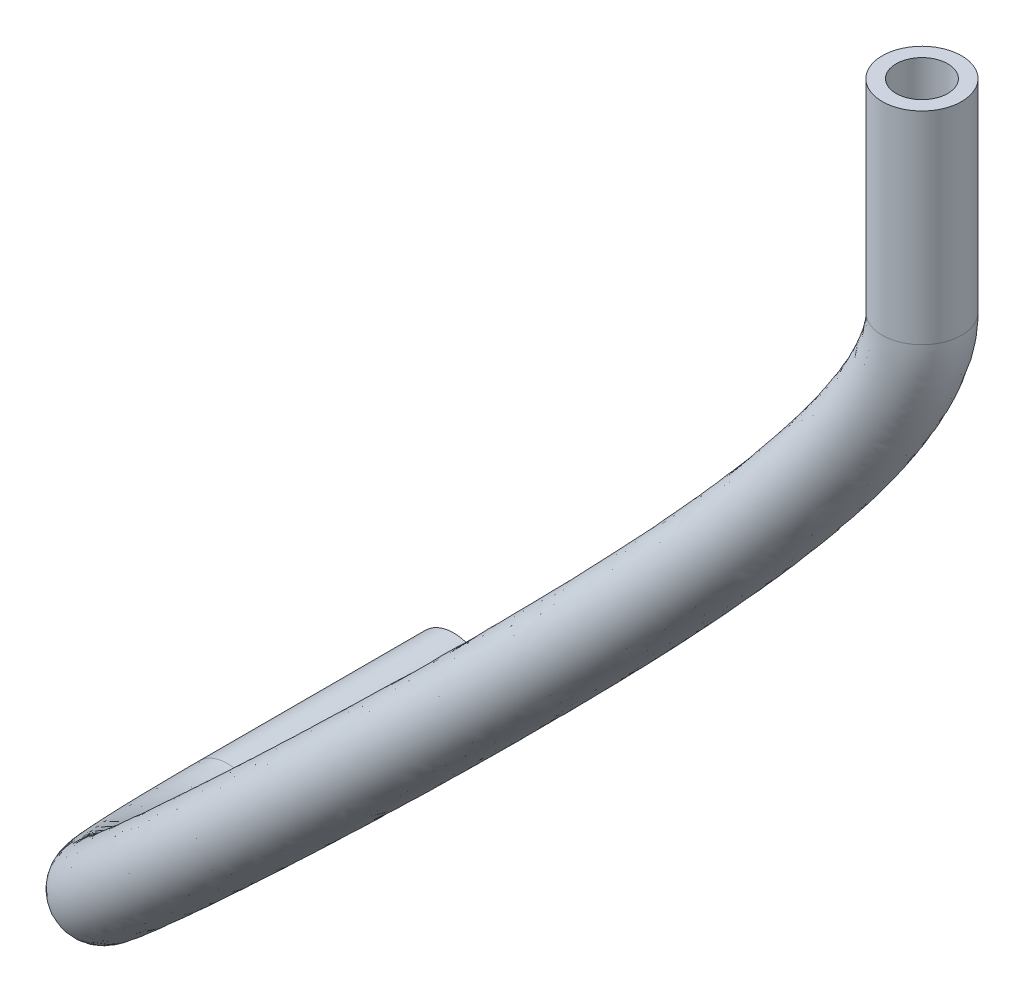
ISO-10303-21;
HEADER;
FILE_DESCRIPTION(('STEP AP214'),'2;1');
FILE_NAME('part.step','',(''),(''),'','','');
FILE_SCHEMA(('AUTOMOTIVE_DESIGN { 1 0 10303 214 1 1 1 1 }'));
ENDSEC;
DATA;
#1=APPLICATION_CONTEXT('core data for automotive mechanical design processes');
#2=APPLICATION_PROTOCOL_DEFINITION('international standard','automotive_design',2000,#1);
#3=PRODUCT_CONTEXT('',#1,'mechanical');
#4=PRODUCT('Part','Part','',(#3));
#5=PRODUCT_RELATED_PRODUCT_CATEGORY('part','',(#4));
#6=PRODUCT_DEFINITION_FORMATION('','',#4);
#7=PRODUCT_DEFINITION_CONTEXT('part definition',#1,'design');
#8=PRODUCT_DEFINITION('design','',#6,#7);
#9=PRODUCT_DEFINITION_SHAPE('','',#8);
#10=(LENGTH_UNIT() NAMED_UNIT(*) SI_UNIT(.MILLI.,.METRE.));
#11=(NAMED_UNIT(*) PLANE_ANGLE_UNIT() SI_UNIT($,.RADIAN.));
#12=(NAMED_UNIT(*) SI_UNIT($,.STERADIAN.) SOLID_ANGLE_UNIT());
#13=UNCERTAINTY_MEASURE_WITH_UNIT(LENGTH_MEASURE(1.E-05),#10,'distance_accuracy_value','');
#14=(GEOMETRIC_REPRESENTATION_CONTEXT(3) GLOBAL_UNCERTAINTY_ASSIGNED_CONTEXT((#13)) GLOBAL_UNIT_ASSIGNED_CONTEXT((#10,
#11,#12)) REPRESENTATION_CONTEXT('',''));
#15=CARTESIAN_POINT('',(0.,0.,0.));
#16=DIRECTION('',(0.,0.,1.));
#17=DIRECTION('',(1.,0.,0.));
#18=AXIS2_PLACEMENT_3D('',#15,#16,#17);
#19=CARTESIAN_POINT('',(-150.085279081331,-109.48225656367,-25.5249999999999));
#20=DIRECTION('',(0.,-1.,0.));
#21=DIRECTION('',(1.,0.,0.));
#22=AXIS2_PLACEMENT_3D('',#19,#20,#21);
#23=CYLINDRICAL_SURFACE('',#22,2.);
#24=CARTESIAN_POINT('',(-150.085279081331,-119.68225656367,-25.5249999999999));
#25=DIRECTION('',(0.,1.,0.));
#26=DIRECTION('',(0.550918603506274,0.,-0.834558980726166));
#27=AXIS2_PLACEMENT_3D('',#24,#25,#26);
#28=CIRCLE('',#27,2.);
#29=CARTESIAN_POINT('',(-148.983441874318,-119.68225656367,-27.1941179614522));
#30=VERTEX_POINT('',#29);
#31=EDGE_CURVE('E106',#30,#30,#28,.T.);
#32=ORIENTED_EDGE('',*,*,#31,.T.);
#33=EDGE_LOOP('',(#32));
#34=FACE_BOUND('',#33,.T.);
#35=CARTESIAN_POINT('',(-150.085279081331,-109.48225656367,-25.5249999999999));
#36=DIRECTION('',(0.,1.,0.));
#37=DIRECTION('',(0.550918603506274,0.,-0.834558980726166));
#38=AXIS2_PLACEMENT_3D('',#35,#36,#37);
#39=CIRCLE('',#38,2.);
#40=CARTESIAN_POINT('',(-148.983441874318,-109.48225656367,-27.1941179614522));
#41=VERTEX_POINT('',#40);
#42=EDGE_CURVE('E48',#41,#41,#39,.T.);
#43=ORIENTED_EDGE('',*,*,#42,.F.);
#44=EDGE_LOOP('',(#43));
#45=FACE_BOUND('',#44,.T.);
#46=ADVANCED_FACE('F33',(#34,#45),#23,.T.);
#47=CARTESIAN_POINT('',(-148.983441874318,-119.68225656367,-27.1941179614523));
#48=CARTESIAN_POINT('',(-148.983441897184,-120.456039775947,-27.1941179597935));
#49=CARTESIAN_POINT('',(-149.162347550547,-121.244423133549,-27.1869869175737));
#50=CARTESIAN_POINT('',(-149.764550663643,-122.904200186474,-27.1712213938091));
#51=CARTESIAN_POINT('',(-150.192613918836,-123.777961004158,-27.162305851847));
#52=CARTESIAN_POINT('',(-151.813182216644,-126.573543563266,-27.1455997404526));
#53=CARTESIAN_POINT('',(-153.345271112655,-128.671191860527,-27.1476762962332));
#54=CARTESIAN_POINT('',(-159.051089719055,-135.640781444132,-27.2968705727352));
#55=CARTESIAN_POINT('',(-164.337628455707,-141.180299200762,-27.5871290015267));
#56=CARTESIAN_POINT('',(-172.408396611259,-149.283351188635,-28.6011287771844));
#57=CARTESIAN_POINT('',(-174.51038109641,-151.36766540929,-28.9068183581806));
#58=CARTESIAN_POINT('',(-177.709340016986,-154.511126064397,-29.4629408200434));
#59=CARTESIAN_POINT('',(-178.787663561716,-155.556189535605,-29.669291376055));
#60=CARTESIAN_POINT('',(-180.911336099532,-157.683925468385,-30.0807411263178));
#61=CARTESIAN_POINT('',(-181.969791613986,-158.75098605433,-30.2985291854538));
#62=CARTESIAN_POINT('',(-187.261247165362,-164.008463474276,-31.5114807766749));
#63=CARTESIAN_POINT('',(-191.43457191409,-168.038229231615,-32.8225757612156));
#64=CARTESIAN_POINT('',(-196.900296980634,-173.268247260522,-35.4010580197518));
#65=CARTESIAN_POINT('',(-198.590098065337,-174.874862790016,-36.3625477392241));
#66=CARTESIAN_POINT('',(-201.589385937694,-177.716017797002,-38.4940165164925));
#67=CARTESIAN_POINT('',(-202.897981659391,-178.949681476636,-39.6643597337115));
#68=CARTESIAN_POINT('',(-205.028547979079,-180.953663798086,-42.1943373775755));
#69=CARTESIAN_POINT('',(-205.848714192953,-181.722307891496,-43.5494869282504));
#70=CARTESIAN_POINT('',(-206.677088701443,-182.498504583847,-45.7176638956701));
#71=CARTESIAN_POINT('',(-206.887139883348,-182.695274666823,-46.4638053548163));
#72=CARTESIAN_POINT('',(-207.100289998218,-182.895404227859,-47.631300841757));
#73=CARTESIAN_POINT('',(-207.154313688162,-182.946239905505,-48.0286354347202));
#74=CARTESIAN_POINT('',(-207.20884144759,-182.997844753575,-48.6392038488103));
#75=CARTESIAN_POINT('',(-207.222593690969,-183.010932930445,-48.8451564275358));
#76=CARTESIAN_POINT('',(-207.236414145537,-183.0242425514,-49.1580178635063));
#77=CARTESIAN_POINT('',(-207.239885958085,-183.027624988679,-49.2629603231285));
#78=CARTESIAN_POINT('',(-207.243366585763,-183.031095611945,-49.4213914113405));
#79=CARTESIAN_POINT('',(-207.244238926367,-183.031985295598,-49.4743713266637));
#80=CARTESIAN_POINT('',(-207.245403539652,-183.033226418273,-49.5806758159231));
#81=CARTESIAN_POINT('',(-207.245695812187,-183.033618015718,-49.6249759760826));
#82=CARTESIAN_POINT('',(-207.245695812187,-183.033658174273,-49.6875000000002));
#83=CARTESIAN_POINT('',(-152.321677797223,-119.68225656367,-29.3977923754774));
#84=CARTESIAN_POINT('',(-152.321677768971,-119.934449456256,-29.3977923757213));
#85=CARTESIAN_POINT('',(-152.394269291203,-120.37686228989,-29.3945394179097));
#86=CARTESIAN_POINT('',(-152.814419953724,-121.534736218641,-29.3834903196071));
#87=CARTESIAN_POINT('',(-153.154507355048,-122.245616360076,-29.3761467822244));
#88=CARTESIAN_POINT('',(-154.552009034838,-124.65636568068,-29.3617212738474));
#89=CARTESIAN_POINT('',(-155.981517872258,-126.631338921823,-29.3625471001761));
#90=CARTESIAN_POINT('',(-161.443643889273,-133.303237304617,-29.5053475616698));
#91=CARTESIAN_POINT('',(-166.64402741672,-138.76188734774,-29.7879588381301));
#92=CARTESIAN_POINT('',(-174.612796067743,-146.762531812739,-30.7891435297816));
#93=CARTESIAN_POINT('',(-176.688843316581,-148.821115479188,-31.0910680199326));
#94=CARTESIAN_POINT('',(-179.845855303803,-151.923356923575,-31.6398982144051));
#95=CARTESIAN_POINT('',(-180.917955711306,-152.948955956534,-31.8296533211223));
#96=CARTESIAN_POINT('',(-182.963498828231,-155.078212876033,-32.3172261657293));
#97=CARTESIAN_POINT('',(-183.97156530236,-156.15156159579,-32.5873976647357));
#98=CARTESIAN_POINT('',(-189.049407452233,-161.402709374212,-33.973373880025));
#99=CARTESIAN_POINT('',(-193.075921694928,-165.375550337584,-35.3255075867565));
#100=CARTESIAN_POINT('',(-198.264893594861,-170.428476492511,-37.8679826223907));
#101=CARTESIAN_POINT('',(-199.85277465201,-171.959881986369,-38.7990218512336));
#102=CARTESIAN_POINT('',(-202.611743508533,-174.608353354422,-40.8016295808639));
#103=CARTESIAN_POINT('',(-203.780269775653,-175.722944562847,-41.8741448271047));
#104=CARTESIAN_POINT('',(-205.59480246807,-177.451081126897,-44.061068228466));
#105=CARTESIAN_POINT('',(-206.235654171147,-178.059856042294,-45.16263111329));
#106=CARTESIAN_POINT('',(-206.847945594157,-178.644259445172,-46.7932938942775));
#107=CARTESIAN_POINT('',(-206.99646256431,-178.786645667883,-47.3356196697458));
#108=CARTESIAN_POINT('',(-207.146361374482,-178.931985252226,-48.1804233475116));
#109=CARTESIAN_POINT('',(-207.18407146393,-178.968954135262,-48.467592009551));
#110=CARTESIAN_POINT('',(-207.221805434308,-179.006842154852,-48.9127414453875));
#111=CARTESIAN_POINT('',(-207.231228590174,-179.016528740498,-49.0635297359131));
#112=CARTESIAN_POINT('',(-207.240428627077,-179.02646445453,-49.294072067111));
#113=CARTESIAN_POINT('',(-207.242671846329,-179.029009726136,-49.3716458341776));
#114=CARTESIAN_POINT('',(-207.244767524197,-179.031647140509,-49.4891855234972));
#115=CARTESIAN_POINT('',(-207.245254500818,-179.032329476415,-49.528561886727));
#116=CARTESIAN_POINT('',(-207.245798962205,-179.033294835005,-49.6077219448447));
#117=CARTESIAN_POINT('',(-207.245776129297,-179.033618015718,-49.6317286013142));
#118=CARTESIAN_POINT('',(-207.245695812187,-179.033658174273,-49.6875000000002));
#119=CARTESIAN_POINT('',(-154.525352211248,-119.68225656367,-26.0595564525727));
#120=CARTESIAN_POINT('',(-154.525352142405,-119.558722181537,-26.0595564542233));
#121=CARTESIAN_POINT('',(-154.522381395833,-119.762565249145,-26.0590466544318));
#122=CARTESIAN_POINT('',(-154.820973677586,-120.585551821401,-26.051145031679));
#123=CARTESIAN_POINT('',(-155.105533377014,-121.195380128233,-26.0447679320219));
#124=CARTESIAN_POINT('',(-156.371997046522,-123.380118861525,-26.0316803428964));
#125=CARTESIAN_POINT('',(-157.755130044631,-125.304225375806,-26.0316630280117));
#126=CARTESIAN_POINT('',(-163.138453544637,-131.879901609233,-26.1723890335801));
#127=CARTESIAN_POINT('',(-168.360221199002,-137.367710714703,-26.4538717577234));
#128=CARTESIAN_POINT('',(-176.39648534191,-145.436120676431,-27.4635364796285));
#129=CARTESIAN_POINT('',(-178.494231252472,-147.516280129659,-27.7684992766372));
#130=CARTESIAN_POINT('',(-181.692144665401,-150.658713419883,-28.324439967437));
#131=CARTESIAN_POINT('',(-182.770590709896,-151.710191032389,-28.5075673048871));
#132=CARTESIAN_POINT('',(-184.901535691994,-153.806411140357,-29.0569218958629));
#133=CARTESIAN_POINT('',(-185.962445352324,-154.852068221561,-29.3701251802754));
#134=CARTESIAN_POINT('',(-191.256356732263,-160.037689868164,-30.9211361910097));
#135=CARTESIAN_POINT('',(-195.416075377529,-164.045841626745,-32.3571053754043));
#136=CARTESIAN_POINT('',(-200.873848760164,-169.255387693949,-35.0695581250287));
#137=CARTESIAN_POINT('',(-202.562289983673,-170.858179538684,-36.064582668345));
#138=CARTESIAN_POINT('',(-205.563075740601,-173.69694712863,-38.2538156148616));
#139=CARTESIAN_POINT('',(-206.874640878064,-174.932199807307,-39.4482424437249));
#140=CARTESIAN_POINT('',(-209.015147252151,-176.943628052325,-42.0290384328886));
#141=CARTESIAN_POINT('',(-209.842542540059,-177.718382279912,-43.4115320739775));
#142=CARTESIAN_POINT('',(-210.678316525007,-178.500682981376,-45.628908520926));
#143=CARTESIAN_POINT('',(-210.890127919982,-178.698857507296,-46.3926777134203));
#144=CARTESIAN_POINT('',(-211.10379273339,-178.899144335294,-47.587104240912));
#145=CARTESIAN_POINT('',(-211.157639363508,-178.949712929803,-47.9934790446434));
#146=CARTESIAN_POINT('',(-211.211335415395,-179.00039705645,-48.6174318011313));
#147=CARTESIAN_POINT('',(-211.224716905171,-179.013092423794,-48.8278161765493));
#148=CARTESIAN_POINT('',(-211.237843063218,-179.025685873142,-49.147246923369));
#149=CARTESIAN_POINT('',(-211.241060467663,-179.028808475189,-49.2543661043153));
#150=CARTESIAN_POINT('',(-211.244125726474,-179.031858328092,-49.4160386772709));
#151=CARTESIAN_POINT('',(-211.244853987621,-179.032602588111,-49.4700951565673));
#152=CARTESIAN_POINT('',(-211.245719347643,-179.03354266981,-49.5785442671312));
#153=CARTESIAN_POINT('',(-211.245776129297,-179.033698332828,-49.6244442303279));
#154=CARTESIAN_POINT('',(-211.245695812187,-179.033658174273,-49.6875000000002));
#155=CARTESIAN_POINT('',(-151.187116288344,-119.68225656367,-23.8558820385476));
#156=CARTESIAN_POINT('',(-151.187116270617,-120.080312501239,-23.8558820383525));
#157=CARTESIAN_POINT('',(-151.290459655182,-120.630126092804,-23.8514941540847));
#158=CARTESIAN_POINT('',(-151.771104387499,-121.955015789234,-23.838876105892));
#159=CARTESIAN_POINT('',(-152.143639940808,-122.727724772314,-23.8309270016588));
#160=CARTESIAN_POINT('',(-153.633170228314,-125.297296744111,-23.8155588094728));
#161=CARTESIAN_POINT('',(-155.118883285028,-127.34407831451,-23.8167922240688));
#162=CARTESIAN_POINT('',(-160.745899374418,-134.217445748748,-23.9639120446455));
#163=CARTESIAN_POINT('',(-166.05382223793,-139.786122567724,-24.2530419211199));
#164=CARTESIAN_POINT('',(-174.192085885446,-147.956940052327,-25.2755217270313));
#165=CARTESIAN_POINT('',(-176.315769032301,-150.062830059762,-25.5842496149273));
#166=CARTESIAN_POINT('',(-179.555629378584,-153.246482560705,-26.1474825730542));
#167=CARTESIAN_POINT('',(-180.640298560327,-154.317424611459,-26.3472053597986));
#168=CARTESIAN_POINT('',(-182.849372963273,-156.412123732709,-26.8204368564726));
#169=CARTESIAN_POINT('',(-183.960671663951,-157.451492680112,-27.0812567009723));
#170=CARTESIAN_POINT('',(-189.468196445392,-162.643443968186,-28.4592430877442));
#171=CARTESIAN_POINT('',(-193.774725596804,-166.708520520776,-29.8541735498634));
#172=CARTESIAN_POINT('',(-199.509252145881,-172.09515846196,-32.6026335223898));
#173=CARTESIAN_POINT('',(-201.299613396984,-173.773160342381,-33.6281085563858));
#174=CARTESIAN_POINT('',(-204.540718169778,-176.80461157116,-35.94620255044));
#175=CARTESIAN_POINT('',(-205.992352761801,-178.158936721095,-37.2384573503462));
#176=CARTESIAN_POINT('',(-208.44889276316,-180.446210723514,-40.1623075819836));
#177=CARTESIAN_POINT('',(-209.455602561864,-181.380834129114,-41.7983878889379));
#178=CARTESIAN_POINT('',(-210.507459632294,-182.354928120051,-44.5532785223186));
#179=CARTESIAN_POINT('',(-210.780805239019,-182.607486506236,-45.5208633984908));
#180=CARTESIAN_POINT('',(-211.057721357127,-182.862563310927,-47.0379817351574));
#181=CARTESIAN_POINT('',(-211.12788158774,-182.926998700047,-47.5545224698125));
#182=CARTESIAN_POINT('',(-211.198371428676,-182.991399655173,-48.3438942045541));
#183=CARTESIAN_POINT('',(-211.216082005965,-183.007496613741,-48.6094428681716));
#184=CARTESIAN_POINT('',(-211.233828581678,-183.023463970012,-49.0111927197644));
#185=CARTESIAN_POINT('',(-211.238274579419,-183.027423737732,-49.1456805932664));
#186=CARTESIAN_POINT('',(-211.242724788039,-183.031306799528,-49.3482445651141));
#187=CARTESIAN_POINT('',(-211.24383841317,-183.032258407294,-49.4159045965041));
#188=CARTESIAN_POINT('',(-211.245323925091,-183.033474253078,-49.5514981382094));
#189=CARTESIAN_POINT('',(-211.245695812187,-183.033698332828,-49.6176916050963));
#190=CARTESIAN_POINT('',(-211.245695812187,-183.033658174273,-49.6875000000002));
#191=CARTESIAN_POINT('',(-147.848880365439,-119.68225656367,-21.6522076245225));
#192=CARTESIAN_POINT('',(-147.84888039883,-120.60190282094,-21.6522076224815));
#193=CARTESIAN_POINT('',(-148.058537914531,-121.497686936463,-21.6439416537376));
#194=CARTESIAN_POINT('',(-148.721235097412,-123.324479757067,-21.626607180105));
#195=CARTESIAN_POINT('',(-149.181746504603,-124.260069416396,-21.6170860712957));
#196=CARTESIAN_POINT('',(-150.894343410105,-127.214474626696,-21.5994372760493));
#197=CARTESIAN_POINT('',(-152.482636525426,-129.383931253213,-21.6019214201258));
#198=CARTESIAN_POINT('',(-158.353345204199,-136.554989888262,-21.7554350557109));
#199=CARTESIAN_POINT('',(-163.747423276857,-142.204534420746,-22.0522120845165));
#200=CARTESIAN_POINT('',(-171.987686428982,-150.477759428223,-23.0875069744341));
#201=CARTESIAN_POINT('',(-174.137306812129,-152.609379989864,-23.3999999532174));
#202=CARTESIAN_POINT('',(-177.419114091766,-155.834251701528,-23.9705251786715));
#203=CARTESIAN_POINT('',(-178.510006410759,-156.92465819053,-24.1868434147102));
#204=CARTESIAN_POINT('',(-180.797210234552,-159.017836325062,-24.5839518170823));
#205=CARTESIAN_POINT('',(-181.958897975577,-160.050917138663,-24.7923882216693));
#206=CARTESIAN_POINT('',(-187.68003615852,-165.249198068208,-25.9973499844788));
#207=CARTESIAN_POINT('',(-192.133375816079,-169.371199414808,-27.3512417243225));
#208=CARTESIAN_POINT('',(-198.144655531597,-174.934929229971,-30.1357089197509));
#209=CARTESIAN_POINT('',(-200.036936810294,-176.688141146078,-31.1916344444265));
#210=CARTESIAN_POINT('',(-203.518360598955,-179.91227601369,-33.6385894860183));
#211=CARTESIAN_POINT('',(-205.110064645539,-181.385673634884,-35.0286722569674));
#212=CARTESIAN_POINT('',(-207.882638274168,-183.948793394704,-38.2955767310787));
#213=CARTESIAN_POINT('',(-209.06866258367,-185.043285978316,-40.1852437038982));
#214=CARTESIAN_POINT('',(-210.33660273958,-186.209173258726,-43.4776485237111));
#215=CARTESIAN_POINT('',(-210.671482558057,-186.516115505175,-44.6490490835612));
#216=CARTESIAN_POINT('',(-211.011649980864,-186.825982286561,-46.4888592294028));
#217=CARTESIAN_POINT('',(-211.098123811973,-186.904284470291,-47.1155658949816));
#218=CARTESIAN_POINT('',(-211.185407441958,-186.982402253896,-48.0703566079769));
#219=CARTESIAN_POINT('',(-211.20744710676,-187.001900803688,-48.3910695597939));
#220=CARTESIAN_POINT('',(-211.229814100138,-187.021242066882,-48.8751385161599));
#221=CARTESIAN_POINT('',(-211.235488691174,-187.026039000275,-49.0369950822175));
#222=CARTESIAN_POINT('',(-211.241323849605,-187.030755270964,-49.2804504529573));
#223=CARTESIAN_POINT('',(-211.242822838719,-187.031914226476,-49.3617140364409));
#224=CARTESIAN_POINT('',(-211.244928502538,-187.033405836347,-49.5244520092876));
#225=CARTESIAN_POINT('',(-211.245615495076,-187.033698332828,-49.6109389798647));
#226=CARTESIAN_POINT('',(-211.245695812187,-187.033658174273,-49.6875000000002));
#227=CARTESIAN_POINT('',(-145.645205951414,-119.68225656367,-24.9904435474272));
#228=CARTESIAN_POINT('',(-145.645206025396,-120.977630095638,-24.9904435438657));
#229=CARTESIAN_POINT('',(-145.930425809891,-122.111983977208,-24.9794344172375));
#230=CARTESIAN_POINT('',(-146.714681373561,-124.273664154307,-24.9589524680111));
#231=CARTESIAN_POINT('',(-147.230720482623,-125.310305648239,-24.9484649214695));
#232=CARTESIAN_POINT('',(-149.074355398451,-128.490721445852,-24.9294782070577));
#233=CARTESIAN_POINT('',(-150.709024353052,-130.71104479923,-24.9328054922902));
#234=CARTESIAN_POINT('',(-156.658535548836,-137.978325583646,-25.0883935838006));
#235=CARTESIAN_POINT('',(-162.031229494695,-143.598711053783,-25.3862991649232));
#236=CARTESIAN_POINT('',(-170.203997154775,-151.80417056453,-26.4131140245872));
#237=CARTESIAN_POINT('',(-172.331918876238,-153.914215339393,-26.7225686964287));
#238=CARTESIAN_POINT('',(-175.572824730169,-157.09889520522,-27.2859834256817));
#239=CARTESIAN_POINT('',(-176.657371412127,-158.163423114675,-27.5089294309878));
#240=CARTESIAN_POINT('',(-178.859173370832,-160.289638060738,-27.8442560869063));
#241=CARTESIAN_POINT('',(-179.968017925612,-161.35041051287,-28.0096607061719));
#242=CARTESIAN_POINT('',(-185.473086878491,-166.61421757434,-29.0495876733247));
#243=CARTESIAN_POINT('',(-189.793222133252,-170.700908125646,-30.3196439356747));
#244=CARTESIAN_POINT('',(-195.535700366407,-176.108018028533,-32.9341334171129));
#245=CARTESIAN_POINT('',(-197.327421478664,-177.789843593662,-33.9260736272146));
#246=CARTESIAN_POINT('',(-200.567028366854,-180.823682239582,-36.186403452121));
#247=CARTESIAN_POINT('',(-202.015693543128,-182.176418390424,-37.4545746403184));
#248=CARTESIAN_POINT('',(-204.462293490087,-184.456246469275,-40.327606526685));
#249=CARTESIAN_POINT('',(-205.461774214758,-185.384759740698,-41.9363427432107));
#250=CARTESIAN_POINT('',(-206.50623180873,-186.352749722522,-44.6420338970626));
#251=CARTESIAN_POINT('',(-206.777817202385,-186.603903665762,-45.5919910398868));
#252=CARTESIAN_POINT('',(-207.054218621955,-186.858823203493,-47.0821783360024));
#253=CARTESIAN_POINT('',(-207.124555912395,-186.923525675749,-47.5896788598893));
#254=CARTESIAN_POINT('',(-207.195877460871,-186.988847352298,-48.3656662522331));
#255=CARTESIAN_POINT('',(-207.213958791763,-187.005337120392,-48.6267831191585));
#256=CARTESIAN_POINT('',(-207.232399663997,-187.022020648269,-49.0219636599016));
#257=CARTESIAN_POINT('',(-207.23710006984,-187.026240251222,-49.1542748120793));
#258=CARTESIAN_POINT('',(-207.241965647328,-187.030544083382,-49.3535972991838));
#259=CARTESIAN_POINT('',(-207.243223351916,-187.03164111478,-49.4201807666004));
#260=CARTESIAN_POINT('',(-207.245008117099,-187.033158001542,-49.5536296870014));
#261=CARTESIAN_POINT('',(-207.245615495076,-187.033618015718,-49.618223350851));
#262=CARTESIAN_POINT('',(-207.245695812187,-187.033658174273,-49.6875000000002));
#263=CARTESIAN_POINT('',(-148.983441874318,-119.68225656367,-27.1941179614523));
#264=CARTESIAN_POINT('',(-148.983441897184,-120.456039775947,-27.1941179597935));
#265=CARTESIAN_POINT('',(-149.162347550547,-121.244423133549,-27.1869869175737));
#266=CARTESIAN_POINT('',(-149.764550663643,-122.904200186474,-27.1712213938091));
#267=CARTESIAN_POINT('',(-150.192613918836,-123.777961004158,-27.162305851847));
#268=CARTESIAN_POINT('',(-151.813182216644,-126.573543563266,-27.1455997404526));
#269=CARTESIAN_POINT('',(-153.345271112655,-128.671191860527,-27.1476762962332));
#270=CARTESIAN_POINT('',(-159.051089719055,-135.640781444132,-27.2968705727352));
#271=CARTESIAN_POINT('',(-164.337628455707,-141.180299200762,-27.5871290015267));
#272=CARTESIAN_POINT('',(-172.408396611259,-149.283351188635,-28.6011287771844));
#273=CARTESIAN_POINT('',(-174.51038109641,-151.36766540929,-28.9068183581806));
#274=CARTESIAN_POINT('',(-177.709340016986,-154.511126064397,-29.4629408200434));
#275=CARTESIAN_POINT('',(-178.787663561716,-155.556189535605,-29.669291376055));
#276=CARTESIAN_POINT('',(-180.911336099532,-157.683925468385,-30.0807411263178));
#277=CARTESIAN_POINT('',(-181.969791613986,-158.75098605433,-30.2985291854538));
#278=CARTESIAN_POINT('',(-187.261247165362,-164.008463474276,-31.5114807766749));
#279=CARTESIAN_POINT('',(-191.43457191409,-168.038229231615,-32.8225757612156));
#280=CARTESIAN_POINT('',(-196.900296980634,-173.268247260522,-35.4010580197518));
#281=CARTESIAN_POINT('',(-198.590098065337,-174.874862790016,-36.3625477392241));
#282=CARTESIAN_POINT('',(-201.589385937694,-177.716017797002,-38.4940165164925));
#283=CARTESIAN_POINT('',(-202.897981659391,-178.949681476636,-39.6643597337115));
#284=CARTESIAN_POINT('',(-205.028547979079,-180.953663798086,-42.1943373775755));
#285=CARTESIAN_POINT('',(-205.848714192953,-181.722307891496,-43.5494869282504));
#286=CARTESIAN_POINT('',(-206.677088701443,-182.498504583847,-45.7176638956701));
#287=CARTESIAN_POINT('',(-206.887139883348,-182.695274666823,-46.4638053548163));
#288=CARTESIAN_POINT('',(-207.100289998218,-182.895404227859,-47.631300841757));
#289=CARTESIAN_POINT('',(-207.154313688162,-182.946239905505,-48.0286354347202));
#290=CARTESIAN_POINT('',(-207.20884144759,-182.997844753575,-48.6392038488103));
#291=CARTESIAN_POINT('',(-207.222593690969,-183.010932930445,-48.8451564275358));
#292=CARTESIAN_POINT('',(-207.236414145537,-183.0242425514,-49.1580178635063));
#293=CARTESIAN_POINT('',(-207.239885958085,-183.027624988679,-49.2629603231285));
#294=CARTESIAN_POINT('',(-207.243366585763,-183.031095611945,-49.4213914113405));
#295=CARTESIAN_POINT('',(-207.244238926367,-183.031985295598,-49.4743713266637));
#296=CARTESIAN_POINT('',(-207.245403539652,-183.033226418273,-49.5806758159231));
#297=CARTESIAN_POINT('',(-207.245695812187,-183.033618015718,-49.6249759760826));
#298=CARTESIAN_POINT('',(-207.245695812187,-183.033658174273,-49.6875000000002));
#299=(BOUNDED_SURFACE() B_SPLINE_SURFACE(3,3,((#47,#48,#49,#50,#51,#52,#53,#54,#55,#56,#57,#58,
#59,#60,#61,#62,#63,#64,#65,#66,#67,#68,#69,#70,#71,#72,#73,#74,#75,#76,#77,#78,#79,#80,#81,
#82),(#83,#84,#85,#86,#87,#88,#89,#90,#91,#92,#93,#94,#95,#96,#97,#98,#99,#100,#101,#102,#103,
#104,#105,#106,#107,#108,#109,#110,#111,#112,#113,#114,#115,#116,#117,#118),(#119,#120,#121,
#122,#123,#124,#125,#126,#127,#128,#129,#130,#131,#132,#133,#134,#135,#136,#137,#138,#139,#140,
#141,#142,#143,#144,#145,#146,#147,#148,#149,#150,#151,#152,#153,#154),(#155,#156,#157,#158,
#159,#160,#161,#162,#163,#164,#165,#166,#167,#168,#169,#170,#171,#172,#173,#174,#175,#176,#177,
#178,#179,#180,#181,#182,#183,#184,#185,#186,#187,#188,#189,#190),(#191,#192,#193,#194,#195,
#196,#197,#198,#199,#200,#201,#202,#203,#204,#205,#206,#207,#208,#209,#210,#211,#212,#213,#214,
#215,#216,#217,#218,#219,#220,#221,#222,#223,#224,#225,#226),(#227,#228,#229,#230,#231,#232,
#233,#234,#235,#236,#237,#238,#239,#240,#241,#242,#243,#244,#245,#246,#247,#248,#249,#250,#251,
#252,#253,#254,#255,#256,#257,#258,#259,#260,#261,#262),(#263,#264,#265,#266,#267,#268,#269,
#270,#271,#272,#273,#274,#275,#276,#277,#278,#279,#280,#281,#282,#283,#284,#285,#286,#287,#288,
#289,#290,#291,#292,#293,#294,#295,#296,#297,#298)),.UNSPECIFIED.,.T.,.F.,
.F.) B_SPLINE_SURFACE_WITH_KNOTS((4,3,4),(4,2,2,2,2,2,2,2,2,2,2,2,2,2,2,2,2,4),(0.,0.5,1.),
(0.0866142428620652,0.130361166483788,0.17410809010551,0.261601937348956,0.436589631835846,
0.494915408632989,0.52407829703156,0.553241185430131,0.669892739024416,0.728218515821559,
0.786544292618701,0.844870069415844,0.874032957814415,0.8886144020137,0.895905124113343,
0.899550485163165,0.901373165688075,0.903195846212986),
.UNSPECIFIED.) GEOMETRIC_REPRESENTATION_ITEM() RATIONAL_B_SPLINE_SURFACE(((1.,1.,1.,1.,1.,1.,1.,
1.,1.,1.,1.,1.,1.,1.,1.,1.,1.,1.,1.,1.,1.,1.,1.,1.,1.,1.,1.,1.,1.,1.,1.,1.,1.,1.,1.,1.),
(0.333333333333333,0.333333333333333,0.333333333333333,0.333333333333333,0.333333333333333,
0.333333333333333,0.333333333333333,0.333333333333333,0.333333333333333,0.333333333333333,
0.333333333333333,0.333333333333333,0.333333333333333,0.333333333333333,0.333333333333333,
0.333333333333333,0.333333333333333,0.333333333333333,0.333333333333333,0.333333333333333,
0.333333333333333,0.333333333333333,0.333333333333333,0.333333333333333,0.333333333333333,
0.333333333333333,0.333333333333333,0.333333333333333,0.333333333333333,0.333333333333333,
0.333333333333333,0.333333333333333,0.333333333333333,0.333333333333333,0.333333333333333,
0.333333333333333),(0.333333333333333,0.333333333333333,0.333333333333333,0.333333333333333,
0.333333333333333,0.333333333333333,0.333333333333333,0.333333333333333,0.333333333333333,
0.333333333333333,0.333333333333333,0.333333333333333,0.333333333333333,0.333333333333333,
0.333333333333333,0.333333333333333,0.333333333333333,0.333333333333333,0.333333333333333,
0.333333333333333,0.333333333333333,0.333333333333333,0.333333333333333,0.333333333333333,
0.333333333333333,0.333333333333333,0.333333333333333,0.333333333333333,0.333333333333333,
0.333333333333333,0.333333333333333,0.333333333333333,0.333333333333333,0.333333333333333,
0.333333333333333,0.333333333333333),(1.,1.,1.,1.,1.,1.,1.,1.,1.,1.,1.,1.,1.,1.,1.,1.,1.,1.,1.,
1.,1.,1.,1.,1.,1.,1.,1.,1.,1.,1.,1.,1.,1.,1.,1.,1.),(0.333333333333333,0.333333333333333,
0.333333333333333,0.333333333333333,0.333333333333333,0.333333333333333,0.333333333333333,
0.333333333333333,0.333333333333333,0.333333333333333,0.333333333333333,0.333333333333333,
0.333333333333333,0.333333333333333,0.333333333333333,0.333333333333333,0.333333333333333,
0.333333333333333,0.333333333333333,0.333333333333333,0.333333333333333,0.333333333333333,
0.333333333333333,0.333333333333333,0.333333333333333,0.333333333333333,0.333333333333333,
0.333333333333333,0.333333333333333,0.333333333333333,0.333333333333333,0.333333333333333,
0.333333333333333,0.333333333333333,0.333333333333333,0.333333333333333),(0.333333333333333,
0.333333333333333,0.333333333333333,0.333333333333333,0.333333333333333,0.333333333333333,
0.333333333333333,0.333333333333333,0.333333333333333,0.333333333333333,0.333333333333333,
0.333333333333333,0.333333333333333,0.333333333333333,0.333333333333333,0.333333333333333,
0.333333333333333,0.333333333333333,0.333333333333333,0.333333333333333,0.333333333333333,
0.333333333333333,0.333333333333333,0.333333333333333,0.333333333333333,0.333333333333333,
0.333333333333333,0.333333333333333,0.333333333333333,0.333333333333333,0.333333333333333,
0.333333333333333,0.333333333333333,0.333333333333333,0.333333333333333,0.333333333333333),(1.,
1.,1.,1.,1.,1.,1.,1.,1.,1.,1.,1.,1.,1.,1.,1.,1.,1.,1.,1.,1.,1.,1.,1.,1.,1.,1.,1.,1.,1.,1.,1.,1.,
1.,1.,1.))) REPRESENTATION_ITEM('') SURFACE());
#300=CARTESIAN_POINT('',(-209.245695812186,-183.033658174273,-49.6875000000018));
#301=DIRECTION('',(0.,0.,1.));
#302=DIRECTION('',(1.,0.,0.));
#303=AXIS2_PLACEMENT_3D('',#300,#301,#302);
#304=CIRCLE('',#303,2.);
#305=CARTESIAN_POINT('',(-207.245695812186,-183.033658174273,-49.6875000000018));
#306=VERTEX_POINT('',#305);
#307=EDGE_CURVE('E37',#306,#306,#304,.T.);
#308=ORIENTED_EDGE('',*,*,#307,.T.);
#309=EDGE_LOOP('',(#308));
#310=FACE_BOUND('',#309,.T.);
#311=ORIENTED_EDGE('',*,*,#31,.F.);
#312=EDGE_LOOP('',(#311));
#313=FACE_BOUND('',#312,.T.);
#314=ADVANCED_FACE('F113',(#310,#313),#299,.F.);
#315=CARTESIAN_POINT('',(-209.245695812187,-183.033658174273,-49.6875000000002));
#316=DIRECTION('',(0.,0.,-1.));
#317=DIRECTION('',(0.,1.,0.));
#318=AXIS2_PLACEMENT_3D('',#315,#316,#317);
#319=CYLINDRICAL_SURFACE('',#318,2.);
#320=CARTESIAN_POINT('',(-209.245695812187,-183.033658174273,-61.0875000000002));
#321=DIRECTION('',(0.,0.,1.));
#322=DIRECTION('',(1.,0.,0.));
#323=AXIS2_PLACEMENT_3D('',#320,#321,#322);
#324=CIRCLE('',#323,2.);
#325=CARTESIAN_POINT('',(-207.245695812187,-183.033658174273,-61.0875000000002));
#326=VERTEX_POINT('',#325);
#327=EDGE_CURVE('E53',#326,#326,#324,.T.);
#328=ORIENTED_EDGE('',*,*,#327,.T.);
#329=EDGE_LOOP('',(#328));
#330=FACE_BOUND('',#329,.T.);
#331=ORIENTED_EDGE('',*,*,#307,.F.);
#332=EDGE_LOOP('',(#331));
#333=FACE_BOUND('',#332,.T.);
#334=ADVANCED_FACE('F35',(#330,#333),#319,.T.);
#335=CARTESIAN_POINT('',(-150.085279081331,-109.48225656367,-25.5249999999999));
#336=DIRECTION('',(0.,1.,0.));
#337=DIRECTION('',(0.550918603506274,0.,-0.834558980726166));
#338=AXIS2_PLACEMENT_3D('',#335,#336,#337);
#339=PLANE('',#338);
#340=CARTESIAN_POINT('',(-150.085279081331,-109.48225656367,-25.5249999999999));
#341=DIRECTION('',(0.,1.,0.));
#342=DIRECTION('',(0.550918603506274,0.,-0.834558980726166));
#343=AXIS2_PLACEMENT_3D('',#340,#341,#342);
#344=CIRCLE('',#343,1.30000000000001);
#345=CARTESIAN_POINT('',(-149.369084896773,-109.48225656367,-26.6099266749439));
#346=VERTEX_POINT('',#345);
#347=EDGE_CURVE('E99',#346,#346,#344,.F.);
#348=ORIENTED_EDGE('',*,*,#347,.T.);
#349=EDGE_LOOP('',(#348));
#350=FACE_BOUND('',#349,.T.);
#351=ORIENTED_EDGE('',*,*,#42,.T.);
#352=EDGE_LOOP('',(#351));
#353=FACE_BOUND('',#352,.T.);
#354=ADVANCED_FACE('F66',(#350,#353),#339,.T.);
#355=CARTESIAN_POINT('',(-209.245695812187,-183.033658174273,-61.0875000000002));
#356=DIRECTION('',(0.,0.,1.));
#357=DIRECTION('',(1.,0.,0.));
#358=AXIS2_PLACEMENT_3D('',#355,#356,#357);
#359=PLANE('',#358);
#360=CARTESIAN_POINT('',(-209.245695812187,-183.033658174273,-61.0875000000002));
#361=DIRECTION('',(0.,0.,1.));
#362=DIRECTION('',(1.,0.,0.));
#363=AXIS2_PLACEMENT_3D('',#360,#361,#362);
#364=CIRCLE('',#363,1.30000000000001);
#365=CARTESIAN_POINT('',(-207.945695812187,-183.033658174273,-61.0875000000002));
#366=VERTEX_POINT('',#365);
#367=EDGE_CURVE('E11',#366,#366,#364,.F.);
#368=ORIENTED_EDGE('',*,*,#367,.F.);
#369=EDGE_LOOP('',(#368));
#370=FACE_BOUND('',#369,.T.);
#371=ORIENTED_EDGE('',*,*,#327,.F.);
#372=EDGE_LOOP('',(#371));
#373=FACE_BOUND('',#372,.T.);
#374=ADVANCED_FACE('F63',(#370,#373),#359,.F.);
#375=CARTESIAN_POINT('',(-150.085279081331,-109.48225656367,-25.5249999999999));
#376=DIRECTION('',(0.,-1.,0.));
#377=DIRECTION('',(1.,0.,0.));
#378=AXIS2_PLACEMENT_3D('',#375,#376,#377);
#379=CYLINDRICAL_SURFACE('',#378,1.30000000000001);
#380=CARTESIAN_POINT('',(-150.085279081331,-119.68225656367,-25.5249999999999));
#381=DIRECTION('',(0.,1.,0.));
#382=DIRECTION('',(0.550918603506274,0.,-0.834558980726166));
#383=AXIS2_PLACEMENT_3D('',#380,#381,#382);
#384=CIRCLE('',#383,1.30000000000001);
#385=CARTESIAN_POINT('',(-149.369084896773,-119.68225656367,-26.6099266749439));
#386=VERTEX_POINT('',#385);
#387=EDGE_CURVE('E98',#386,#386,#384,.F.);
#388=ORIENTED_EDGE('',*,*,#387,.T.);
#389=EDGE_LOOP('',(#388));
#390=FACE_BOUND('',#389,.T.);
#391=ORIENTED_EDGE('',*,*,#347,.F.);
#392=EDGE_LOOP('',(#391));
#393=FACE_BOUND('',#392,.T.);
#394=ADVANCED_FACE('F65',(#390,#393),#379,.F.);
#395=CARTESIAN_POINT('',(-149.369084896773,-119.68225656367,-26.6099266749439));
#396=CARTESIAN_POINT('',(-149.369084912523,-120.390287502867,-26.6099266734966));
#397=CARTESIAN_POINT('',(-149.534767168853,-121.13692115141,-26.6032756839598));
#398=CARTESIAN_POINT('',(-150.115697565323,-122.738092916965,-26.5880609684269));
#399=CARTESIAN_POINT('',(-150.53404347269,-123.594169663583,-26.5793145530949));
#400=CARTESIAN_POINT('',(-152.131680118669,-126.350200369918,-26.5628425774694));
#401=CARTESIAN_POINT('',(-153.655653242816,-128.438946989993,-26.5647715836416));
#402=CARTESIAN_POINT('',(-159.347681408751,-135.391697697402,-26.713602830245));
#403=CARTESIAN_POINT('',(-164.637962367596,-140.936318289986,-27.0036637625095));
#404=CARTESIAN_POINT('',(-172.720542234242,-149.051229239779,-28.0191475433896));
#405=CARTESIAN_POINT('',(-174.826323985204,-151.139319223186,-28.3253688281134));
#406=CARTESIAN_POINT('',(-178.032440655259,-154.28981345122,-28.8827356268192));
#407=CARTESIAN_POINT('',(-179.111874686523,-155.339405673859,-29.0879263231932));
#408=CARTESIAN_POINT('',(-181.250492550637,-157.461360164662,-29.5101878791119));
#409=CARTESIAN_POINT('',(-182.31819562274,-158.523574713836,-29.7355065006653));
#410=CARTESIAN_POINT('',(-187.647463289325,-163.769585060734,-30.9773391811289));
#411=CARTESIAN_POINT('',(-191.844098808499,-167.805530207247,-32.3031053741799));
#412=CARTESIAN_POINT('',(-199.194452576614,-174.815432225264,-35.7807431855907));
#413=CARTESIAN_POINT('',(-202.345690745314,-177.784521961618,-37.9403741432388));
#414=CARTESIAN_POINT('',(-205.627108316297,-180.86485951003,-41.8387321633577));
#415=CARTESIAN_POINT('',(-206.479919657496,-181.662549983059,-43.2430445963816));
#416=CARTESIAN_POINT('',(-207.347403614351,-182.473378702693,-45.5138964553281));
#417=CARTESIAN_POINT('',(-207.56853132058,-182.67991173871,-46.2987905124582));
#418=CARTESIAN_POINT('',(-207.792840486033,-182.889657067402,-47.5274699981026));
#419=CARTESIAN_POINT('',(-207.849688070584,-182.94287269455,-47.9456656658604));
#420=CARTESIAN_POINT('',(-207.907009194282,-182.996716861354,-48.5875246610659));
#421=CARTESIAN_POINT('',(-207.921454146092,-183.01033157502,-48.803906554646));
#422=CARTESIAN_POINT('',(-207.935961671862,-183.024106299658,-49.132323463352));
#423=CARTESIAN_POINT('',(-207.939603966819,-183.027589769763,-49.2424363704025));
#424=CARTESIAN_POINT('',(-207.943254271161,-183.031132569772,-49.4085907132509));
#425=CARTESIAN_POINT('',(-207.944168836558,-183.032033090144,-49.464139648886));
#426=CARTESIAN_POINT('',(-207.945389607103,-183.033269789365,-49.5755697223229));
#427=CARTESIAN_POINT('',(-207.945695812187,-183.033632071212,-49.62370121116));
#428=CARTESIAN_POINT('',(-207.945695812187,-183.033658174273,-49.6875000000002));
#429=CARTESIAN_POINT('',(-147.199231546885,-119.68225656367,-25.1775383058276));
#430=CARTESIAN_POINT('',(-147.199231595851,-120.72932121067,-25.1775383031849));
#431=CARTESIAN_POINT('',(-147.434018037432,-121.700835699789,-25.1683665587287));
#432=CARTESIAN_POINT('',(-148.133282526765,-123.628244496056,-25.1500861666709));
#433=CARTESIAN_POINT('',(-148.608812739153,-124.590193682231,-25.1403179483488));
#434=CARTESIAN_POINT('',(-150.351442686839,-127.596365993608,-25.1223635807642));
#435=CARTESIAN_POINT('',(-151.942092849047,-129.764851400119,-25.1251055610725));
#436=CARTESIAN_POINT('',(-157.792521198163,-136.911101388149,-25.2780927874499));
#437=CARTESIAN_POINT('',(-163.138803042851,-142.508285994426,-25.5731243686032));
#438=CARTESIAN_POINT('',(-171.287682587556,-150.689761834119,-26.5969379542394));
#439=CARTESIAN_POINT('',(-173.410323542078,-152.794576677729,-26.9056065480041));
#440=CARTESIAN_POINT('',(-176.643705718835,-155.971863392766,-27.4677133204694));
#441=CARTESIAN_POINT('',(-177.727184789281,-157.034107500258,-27.6836910589005));
#442=CARTESIAN_POINT('',(-179.916586776991,-159.155073349689,-28.0564726034933));
#443=CARTESIAN_POINT('',(-181.01704272529,-160.213200611883,-28.2477419891183));
#444=CARTESIAN_POINT('',(-186.485159102888,-165.463325225792,-29.3771086640064));
#445=CARTESIAN_POINT('',(-190.777221450956,-169.536271488401,-30.6761996875896));
#446=CARTESIAN_POINT('',(-198.367427963464,-176.699653130466,-34.1850437588262));
#447=CARTESIAN_POINT('',(-201.669492540877,-179.792251084445,-36.3925212037285));
#448=CARTESIAN_POINT('',(-205.259042898454,-183.141538246293,-40.6253571102746));
#449=CARTESIAN_POINT('',(-206.228408671665,-184.043143685056,-42.1945008761103));
#450=CARTESIAN_POINT('',(-207.236346634089,-184.978638042823,-44.814736956231));
#451=CARTESIAN_POINT('',(-207.497471577954,-185.220520588018,-45.7321112077527));
#452=CARTESIAN_POINT('',(-207.762894091462,-185.465879401564,-47.1705403693628));
#453=CARTESIAN_POINT('',(-207.830345516337,-185.52810844521,-47.6603438922202));
#454=CARTESIAN_POINT('',(-207.898582602915,-185.590868550524,-48.4097252232908));
#455=CARTESIAN_POINT('',(-207.915841461609,-185.606694298487,-48.6619639042008));
#456=CARTESIAN_POINT('',(-207.933352258861,-185.622662062623,-49.0438882310089));
#457=CARTESIAN_POINT('',(-207.937793139461,-185.626689690416,-49.1717907882204));
#458=CARTESIAN_POINT('',(-207.942343661178,-185.630774076206,-49.3645245403491));
#459=CARTESIAN_POINT('',(-207.943508713165,-185.631809372613,-49.4289157848449));
#460=CARTESIAN_POINT('',(-207.945132582444,-185.633225318489,-49.5579897385238));
#461=CARTESIAN_POINT('',(-207.945643606065,-185.633632071212,-49.6193120047595));
#462=CARTESIAN_POINT('',(-207.945695812187,-185.633658174273,-49.6875000000002));
#463=CARTESIAN_POINT('',(-148.631619916001,-119.68225656367,-23.0076849559396));
#464=CARTESIAN_POINT('',(-148.631619938578,-120.485098482117,-23.0076849543052));
#465=CARTESIAN_POINT('',(-148.817290905456,-121.30154262331,-23.0002962624785));
#466=CARTESIAN_POINT('',(-149.43754244726,-123.011274637845,-22.9840617295072));
#467=CARTESIAN_POINT('',(-149.876979653432,-123.907540131544,-22.9749216957366));
#468=CARTESIAN_POINT('',(-151.534434894431,-126.766805561135,-22.9578369756073));
#469=CARTESIAN_POINT('',(-153.094940761098,-128.902227595191,-22.9600309141739));
#470=CARTESIAN_POINT('',(-158.894147474132,-135.985933186182,-23.1116697441751));
#471=CARTESIAN_POINT('',(-164.254329001176,-141.60207118306,-23.4059677661109));
#472=CARTESIAN_POINT('',(-172.447080615818,-149.827594595483,-24.4352933717159));
#473=CARTESIAN_POINT('',(-174.58382570038,-151.946433700494,-24.7459368648852));
#474=CARTESIAN_POINT('',(-177.843793803887,-155.149845115387,-25.3126654599285));
#475=CARTESIAN_POINT('',(-178.931397538353,-156.228910299582,-25.5243351483254));
#476=CARTESIAN_POINT('',(-181.176310738447,-158.32840222148,-25.9372748281024));
#477=CARTESIAN_POINT('',(-182.311114757799,-159.368529918653,-26.1565148741715));
#478=CARTESIAN_POINT('',(-187.919676134781,-164.576062546787,-27.3931541663369));
#479=CARTESIAN_POINT('',(-192.298321344852,-168.671960826299,-28.7467382500823));
#480=CARTESIAN_POINT('',(-200.121489141958,-175.971079725784,-32.4028963403671));
#481=CARTESIAN_POINT('',(-203.574892310919,-179.186197197064,-34.6876760634713));
#482=CARTESIAN_POINT('',(-207.482267008098,-182.811693747804,-39.3045377431615));
#483=CARTESIAN_POINT('',(-208.572886111466,-183.821185739549,-41.0562865005739));
#484=CARTESIAN_POINT('',(-209.726087739138,-184.885313341335,-44.0578864635442));
#485=CARTESIAN_POINT('',(-210.028354059148,-185.163458283644,-45.1191989361434));
#486=CARTESIAN_POINT('',(-210.335224474748,-185.444532805555,-46.7848829500719));
#487=CARTESIAN_POINT('',(-210.413164651064,-185.515601661661,-47.3521704650313));
#488=CARTESIAN_POINT('',(-210.49177709062,-185.586679236563,-48.2177739545238));
#489=CARTESIAN_POINT('',(-210.511608866358,-185.604460692633,-48.5087500906145));
#490=CARTESIAN_POINT('',(-210.531671642352,-185.622155984719,-48.9484518875765));
#491=CARTESIAN_POINT('',(-210.536745743329,-185.626558877301,-49.0955589638102));
#492=CARTESIAN_POINT('',(-210.541926492657,-185.630911348135,-49.3169790903019));
#493=CARTESIAN_POINT('',(-210.543248379586,-185.631986895216,-49.3909124102407));
#494=CARTESIAN_POINT('',(-210.54508083298,-185.633386411112,-49.5390242480103));
#495=CARTESIAN_POINT('',(-210.545643606065,-185.633684277334,-49.6145771636184));
#496=CARTESIAN_POINT('',(-210.545695812187,-185.633658174273,-49.6875000000002));
#497=CARTESIAN_POINT('',(-150.801473265889,-119.68225656367,-24.4400733250559));
#498=CARTESIAN_POINT('',(-150.801473255245,-120.146064774319,-24.4400733246494));
#499=CARTESIAN_POINT('',(-150.918040036877,-120.737628074931,-24.4352053876986));
#500=CARTESIAN_POINT('',(-151.419957485819,-122.121123058754,-24.4220365312742));
#501=CARTESIAN_POINT('',(-151.802210386968,-122.911516112896,-24.4139183004683));
#502=CARTESIAN_POINT('',(-153.314672326261,-125.520639937445,-24.3983159723412));
#503=CARTESIAN_POINT('',(-154.808501154867,-127.576323185044,-24.3996969367431));
#504=CARTESIAN_POINT('',(-160.449307684721,-134.466529495477,-24.5471797869702));
#505=CARTESIAN_POINT('',(-165.753488325921,-140.0301034785,-24.8365071598971));
#506=CARTESIAN_POINT('',(-173.879940262503,-148.189062001183,-25.8575029609061));
#507=CARTESIAN_POINT('',(-175.999826143506,-150.29117624595,-26.1656991449945));
#508=CARTESIAN_POINT('',(-179.232528740311,-153.467795173841,-26.7276877662783));
#509=CARTESIAN_POINT('',(-180.316087435585,-154.534208473184,-26.9285704126605));
#510=CARTESIAN_POINT('',(-182.510216512104,-156.634689036454,-27.3909901036786));
#511=CARTESIAN_POINT('',(-183.612267655238,-157.678904020606,-27.6442793857185));
#512=CARTESIAN_POINT('',(-189.081980321259,-162.882322381728,-28.9933846834595));
#513=CARTESIAN_POINT('',(-193.365198702395,-166.941219545145,-30.3736439367481));
#514=CARTESIAN_POINT('',(-200.948513755108,-174.086858820582,-33.9985957670561));
#515=CARTESIAN_POINT('',(-204.251090515355,-177.178468074236,-36.2355290030105));
#516=CARTESIAN_POINT('',(-207.850332425941,-180.535015011541,-40.5179127962303));
#517=CARTESIAN_POINT('',(-208.824397097296,-181.440592037551,-42.104830220858));
#518=CARTESIAN_POINT('',(-209.837144719399,-182.380054001205,-44.7570459626349));
#519=CARTESIAN_POINT('',(-210.099413801774,-182.622849434336,-45.6858782408489));
#520=CARTESIAN_POINT('',(-210.365170869319,-182.868310471392,-47.1418125788118));
#521=CARTESIAN_POINT('',(-210.432507205312,-182.930365911002,-47.6374922386707));
#522=CARTESIAN_POINT('',(-210.500203681987,-182.992527547394,-48.3955733922993));
#523=CARTESIAN_POINT('',(-210.517221550841,-183.008097969166,-48.6506927410597));
#524=CARTESIAN_POINT('',(-210.534281055353,-183.023600221754,-49.0368871199196));
#525=CARTESIAN_POINT('',(-210.538556570686,-183.027458956648,-49.166204545992));
#526=CARTESIAN_POINT('',(-210.54283710264,-183.031269841701,-49.3610452632038));
#527=CARTESIAN_POINT('',(-210.543908502979,-183.032210612747,-49.4261362742818));
#528=CARTESIAN_POINT('',(-210.545337857639,-183.033430881988,-49.5566042318095));
#529=CARTESIAN_POINT('',(-210.545695812187,-183.033684277334,-49.6189663700189));
#530=CARTESIAN_POINT('',(-210.545695812187,-183.033658174273,-49.6875000000002));
#531=CARTESIAN_POINT('',(-152.971326615777,-119.68225656367,-25.8724616941722));
#532=CARTESIAN_POINT('',(-152.971326571913,-119.80703106652,-25.8724616949935));
#533=CARTESIAN_POINT('',(-153.018789168298,-120.173713526552,-25.8701145129187));
#534=CARTESIAN_POINT('',(-153.402372524377,-121.230971479663,-25.8600113330412));
#535=CARTESIAN_POINT('',(-153.727441120505,-121.915492094248,-25.8529149052));
#536=CARTESIAN_POINT('',(-155.09490975809,-124.274474313754,-25.8387949690751));
#537=CARTESIAN_POINT('',(-156.522061548636,-126.250418774897,-25.8393629593122));
#538=CARTESIAN_POINT('',(-162.004467895309,-132.947125804772,-25.9826898297652));
#539=CARTESIAN_POINT('',(-167.252647650666,-138.45813577394,-26.2670465536834));
#540=CARTESIAN_POINT('',(-175.312799909189,-146.550529406883,-27.2797125500963));
#541=CARTESIAN_POINT('',(-177.415826586632,-148.635918791407,-27.5854614251038));
#542=CARTESIAN_POINT('',(-180.621263676735,-151.785745232295,-28.1427100726282));
#543=CARTESIAN_POINT('',(-181.700777332816,-152.839506646785,-28.3328056769956));
#544=CARTESIAN_POINT('',(-183.844122285761,-154.940975851427,-28.8447053792547));
#545=CARTESIAN_POINT('',(-184.913420552678,-155.989278122559,-29.1320438972655));
#546=CARTESIAN_POINT('',(-190.244284507738,-161.18858221667,-30.5936152005821));
#547=CARTESIAN_POINT('',(-194.432076059938,-165.210478263991,-32.0005496234139));
#548=CARTESIAN_POINT('',(-201.775538368258,-172.20263791538,-35.5942951937451));
#549=CARTESIAN_POINT('',(-204.927288719792,-175.170738951408,-37.7833819425496));
#550=CARTESIAN_POINT('',(-208.218397843784,-178.258336275279,-41.731287849299));
#551=CARTESIAN_POINT('',(-209.075908083126,-179.059998335554,-43.1533739411421));
#552=CARTESIAN_POINT('',(-209.948201699661,-179.874794661074,-45.4562054617255));
#553=CARTESIAN_POINT('',(-210.170473544401,-180.082240585027,-46.2525575455544));
#554=CARTESIAN_POINT('',(-210.39511726389,-180.292088137229,-47.4987422075516));
#555=CARTESIAN_POINT('',(-210.45184975956,-180.345130160343,-47.92281401231));
#556=CARTESIAN_POINT('',(-210.508630273355,-180.398375858224,-48.5733728300748));
#557=CARTESIAN_POINT('',(-210.522834235325,-180.4117352457,-48.7926353915049));
#558=CARTESIAN_POINT('',(-210.536890468354,-180.425044458789,-49.1253223522627));
#559=CARTESIAN_POINT('',(-210.540367398044,-180.428359035995,-49.2368501281739));
#560=CARTESIAN_POINT('',(-210.543747712623,-180.431628335268,-49.4051114361057));
#561=CARTESIAN_POINT('',(-210.544568626372,-180.432434330278,-49.4613601383229));
#562=CARTESIAN_POINT('',(-210.545594882298,-180.433475352863,-49.5741842156087));
#563=CARTESIAN_POINT('',(-210.545748018308,-180.433684277334,-49.6233555764195));
#564=CARTESIAN_POINT('',(-210.545695812187,-180.433658174273,-49.6875000000002));
#565=CARTESIAN_POINT('',(-151.538938246661,-119.68225656367,-28.0423150440602));
#566=CARTESIAN_POINT('',(-151.538938229195,-120.051253795065,-28.0423150438082));
#567=CARTESIAN_POINT('',(-151.635516300274,-120.573006603032,-28.0381848091909));
#568=CARTESIAN_POINT('',(-152.098112603882,-121.847941337874,-28.026035770183));
#569=CARTESIAN_POINT('',(-152.459274206226,-122.598145644935,-28.0183111578409));
#570=CARTESIAN_POINT('',(-153.911917550498,-125.104034746227,-28.0033215741746));
#571=CARTESIAN_POINT('',(-155.369213636585,-127.113042579866,-28.0044376062107));
#572=CARTESIAN_POINT('',(-160.90284161934,-133.872294006656,-28.14911287304));
#573=CARTESIAN_POINT('',(-166.137121692341,-139.364350585546,-28.4342031564157));
#574=CARTESIAN_POINT('',(-174.153401880927,-147.412696645438,-29.4413571325397));
#575=CARTESIAN_POINT('',(-176.24232442833,-149.484061768642,-29.7451311082227));
#576=CARTESIAN_POINT('',(-179.421175591683,-152.607763509674,-30.297757933169));
#577=CARTESIAN_POINT('',(-180.496564583764,-153.644703847461,-30.4921615874858));
#578=CARTESIAN_POINT('',(-182.584398324283,-155.767646979636,-30.9639031547304));
#579=CARTESIAN_POINT('',(-183.619348520191,-156.833948815789,-31.2232710122123));
#580=CARTESIAN_POINT('',(-188.809767475762,-162.075844895675,-32.5775696982515));
#581=CARTESIAN_POINT('',(-192.910976166042,-166.074788926093,-33.9300110607701));
#582=CARTESIAN_POINT('',(-200.021477189764,-172.931211320062,-37.3764426123552));
#583=CARTESIAN_POINT('',(-203.02188894975,-175.77679283879,-39.4882270827491));
#584=CARTESIAN_POINT('',(-205.99517373414,-178.588180773767,-43.0521072164409));
#585=CARTESIAN_POINT('',(-206.731430643326,-179.281956281061,-44.2915883166528));
#586=CARTESIAN_POINT('',(-207.458460594613,-179.968119362562,-46.2130559544252));
#587=CARTESIAN_POINT('',(-207.639591063207,-180.139302889401,-46.8654698171637));
#588=CARTESIAN_POINT('',(-207.822786880603,-180.313434733239,-47.8843996268425));
#589=CARTESIAN_POINT('',(-207.869030624832,-180.357636943891,-48.2309874395006));
#590=CARTESIAN_POINT('',(-207.915435785649,-180.402565172185,-48.765324098841));
#591=CARTESIAN_POINT('',(-207.927066830576,-180.413968851554,-48.9458492050912));
#592=CARTESIAN_POINT('',(-207.938571084863,-180.425550536693,-49.2207586956951));
#593=CARTESIAN_POINT('',(-207.941414794176,-180.42848984911,-49.3130819525845));
#594=CARTESIAN_POINT('',(-207.944164881144,-180.431491063339,-49.4526568861527));
#595=CARTESIAN_POINT('',(-207.944828959951,-180.432256807675,-49.4993635129271));
#596=CARTESIAN_POINT('',(-207.945646631763,-180.433314260241,-49.5931497061221));
#597=CARTESIAN_POINT('',(-207.945748018308,-180.433632071212,-49.6280904175606));
#598=CARTESIAN_POINT('',(-207.945695812187,-180.433658174273,-49.6875000000002));
#599=CARTESIAN_POINT('',(-149.369084896773,-119.68225656367,-26.6099266749439));
#600=CARTESIAN_POINT('',(-149.369084912523,-120.390287502867,-26.6099266734966));
#601=CARTESIAN_POINT('',(-149.534767168853,-121.13692115141,-26.6032756839598));
#602=CARTESIAN_POINT('',(-150.115697565323,-122.738092916965,-26.5880609684269));
#603=CARTESIAN_POINT('',(-150.53404347269,-123.594169663583,-26.5793145530949));
#604=CARTESIAN_POINT('',(-152.131680118669,-126.350200369918,-26.5628425774694));
#605=CARTESIAN_POINT('',(-153.655653242816,-128.438946989993,-26.5647715836416));
#606=CARTESIAN_POINT('',(-159.347681408751,-135.391697697402,-26.713602830245));
#607=CARTESIAN_POINT('',(-164.637962367596,-140.936318289986,-27.0036637625095));
#608=CARTESIAN_POINT('',(-172.720542234242,-149.051229239779,-28.0191475433896));
#609=CARTESIAN_POINT('',(-174.826323985204,-151.139319223186,-28.3253688281134));
#610=CARTESIAN_POINT('',(-178.032440655259,-154.28981345122,-28.8827356268192));
#611=CARTESIAN_POINT('',(-179.111874686523,-155.339405673859,-29.0879263231932));
#612=CARTESIAN_POINT('',(-181.250492550637,-157.461360164662,-29.5101878791119));
#613=CARTESIAN_POINT('',(-182.31819562274,-158.523574713836,-29.7355065006653));
#614=CARTESIAN_POINT('',(-187.647463289325,-163.769585060734,-30.9773391811289));
#615=CARTESIAN_POINT('',(-191.844098808499,-167.805530207247,-32.3031053741799));
#616=CARTESIAN_POINT('',(-199.194452576614,-174.815432225264,-35.7807431855907));
#617=CARTESIAN_POINT('',(-202.345690745314,-177.784521961618,-37.9403741432388));
#618=CARTESIAN_POINT('',(-205.627108316297,-180.86485951003,-41.8387321633577));
#619=CARTESIAN_POINT('',(-206.479919657496,-181.662549983059,-43.2430445963816));
#620=CARTESIAN_POINT('',(-207.347403614351,-182.473378702693,-45.5138964553281));
#621=CARTESIAN_POINT('',(-207.56853132058,-182.67991173871,-46.2987905124582));
#622=CARTESIAN_POINT('',(-207.792840486033,-182.889657067402,-47.5274699981026));
#623=CARTESIAN_POINT('',(-207.849688070584,-182.94287269455,-47.9456656658604));
#624=CARTESIAN_POINT('',(-207.907009194282,-182.996716861354,-48.5875246610659));
#625=CARTESIAN_POINT('',(-207.921454146092,-183.01033157502,-48.803906554646));
#626=CARTESIAN_POINT('',(-207.935961671862,-183.024106299658,-49.132323463352));
#627=CARTESIAN_POINT('',(-207.939603966819,-183.027589769763,-49.2424363704025));
#628=CARTESIAN_POINT('',(-207.943254271161,-183.031132569772,-49.4085907132509));
#629=CARTESIAN_POINT('',(-207.944168836558,-183.032033090144,-49.464139648886));
#630=CARTESIAN_POINT('',(-207.945389607103,-183.033269789365,-49.5755697223229));
#631=CARTESIAN_POINT('',(-207.945695812187,-183.033632071212,-49.62370121116));
#632=CARTESIAN_POINT('',(-207.945695812187,-183.033658174273,-49.6875000000002));
#633=(BOUNDED_SURFACE() B_SPLINE_SURFACE(3,3,((#395,#396,#397,#398,#399,#400,#401,#402,#403,
#404,#405,#406,#407,#408,#409,#410,#411,#412,#413,#414,#415,#416,#417,#418,#419,#420,#421,#422,
#423,#424,#425,#426,#427,#428),(#429,#430,#431,#432,#433,#434,#435,#436,#437,#438,#439,#440,
#441,#442,#443,#444,#445,#446,#447,#448,#449,#450,#451,#452,#453,#454,#455,#456,#457,#458,#459,
#460,#461,#462),(#463,#464,#465,#466,#467,#468,#469,#470,#471,#472,#473,#474,#475,#476,#477,
#478,#479,#480,#481,#482,#483,#484,#485,#486,#487,#488,#489,#490,#491,#492,#493,#494,#495,#496),
(#497,#498,#499,#500,#501,#502,#503,#504,#505,#506,#507,#508,#509,#510,#511,#512,#513,#514,#515,
#516,#517,#518,#519,#520,#521,#522,#523,#524,#525,#526,#527,#528,#529,#530),(#531,#532,#533,
#534,#535,#536,#537,#538,#539,#540,#541,#542,#543,#544,#545,#546,#547,#548,#549,#550,#551,#552,
#553,#554,#555,#556,#557,#558,#559,#560,#561,#562,#563,#564),(#565,#566,#567,#568,#569,#570,
#571,#572,#573,#574,#575,#576,#577,#578,#579,#580,#581,#582,#583,#584,#585,#586,#587,#588,#589,
#590,#591,#592,#593,#594,#595,#596,#597,#598),(#599,#600,#601,#602,#603,#604,#605,#606,#607,
#608,#609,#610,#611,#612,#613,#614,#615,#616,#617,#618,#619,#620,#621,#622,#623,#624,#625,#626,
#627,#628,#629,#630,#631,#632)),.UNSPECIFIED.,.T.,.F.,.F.) B_SPLINE_SURFACE_WITH_KNOTS((4,3,4),
(4,2,2,2,2,2,2,2,2,2,2,2,2,2,2,2,4),(0.,0.5,1.),(0.0866142428620652,0.130361166483788,
0.17410809010551,0.261601937348956,0.436589631835846,0.494915408632989,0.52407829703156,
0.553241185430131,0.669892739024416,0.786544292618701,0.844870069415844,0.874032957814415,
0.8886144020137,0.895905124113343,0.899550485163165,0.901373165688075,0.903195846212986),
.UNSPECIFIED.) GEOMETRIC_REPRESENTATION_ITEM() RATIONAL_B_SPLINE_SURFACE(((1.,1.,1.,1.,1.,1.,1.,
1.,1.,1.,1.,1.,1.,1.,1.,1.,1.,1.,1.,1.,1.,1.,1.,1.,1.,1.,1.,1.,1.,1.,1.,1.,1.,1.),
(0.333333333333333,0.333333333333333,0.333333333333333,0.333333333333333,0.333333333333333,
0.333333333333333,0.333333333333333,0.333333333333333,0.333333333333333,0.333333333333333,
0.333333333333333,0.333333333333333,0.333333333333333,0.333333333333333,0.333333333333333,
0.333333333333333,0.333333333333333,0.333333333333333,0.333333333333333,0.333333333333333,
0.333333333333333,0.333333333333333,0.333333333333333,0.333333333333333,0.333333333333333,
0.333333333333333,0.333333333333333,0.333333333333333,0.333333333333333,0.333333333333333,
0.333333333333333,0.333333333333333,0.333333333333333,0.333333333333333),(0.333333333333333,
0.333333333333333,0.333333333333333,0.333333333333333,0.333333333333333,0.333333333333333,
0.333333333333333,0.333333333333333,0.333333333333333,0.333333333333333,0.333333333333333,
0.333333333333333,0.333333333333333,0.333333333333333,0.333333333333333,0.333333333333333,
0.333333333333333,0.333333333333333,0.333333333333333,0.333333333333333,0.333333333333333,
0.333333333333333,0.333333333333333,0.333333333333333,0.333333333333333,0.333333333333333,
0.333333333333333,0.333333333333333,0.333333333333333,0.333333333333333,0.333333333333333,
0.333333333333333,0.333333333333333,0.333333333333333),(1.,1.,1.,1.,1.,1.,1.,1.,1.,1.,1.,1.,1.,
1.,1.,1.,1.,1.,1.,1.,1.,1.,1.,1.,1.,1.,1.,1.,1.,1.,1.,1.,1.,1.),(0.333333333333333,
0.333333333333333,0.333333333333333,0.333333333333333,0.333333333333333,0.333333333333333,
0.333333333333333,0.333333333333333,0.333333333333333,0.333333333333333,0.333333333333333,
0.333333333333333,0.333333333333333,0.333333333333333,0.333333333333333,0.333333333333333,
0.333333333333333,0.333333333333333,0.333333333333333,0.333333333333333,0.333333333333333,
0.333333333333333,0.333333333333333,0.333333333333333,0.333333333333333,0.333333333333333,
0.333333333333333,0.333333333333333,0.333333333333333,0.333333333333333,0.333333333333333,
0.333333333333333,0.333333333333333,0.333333333333333),(0.333333333333333,0.333333333333333,
0.333333333333333,0.333333333333333,0.333333333333333,0.333333333333333,0.333333333333333,
0.333333333333333,0.333333333333333,0.333333333333333,0.333333333333333,0.333333333333333,
0.333333333333333,0.333333333333333,0.333333333333333,0.333333333333333,0.333333333333333,
0.333333333333333,0.333333333333333,0.333333333333333,0.333333333333333,0.333333333333333,
0.333333333333333,0.333333333333333,0.333333333333333,0.333333333333333,0.333333333333333,
0.333333333333333,0.333333333333333,0.333333333333333,0.333333333333333,0.333333333333333,
0.333333333333333,0.333333333333333),(1.,1.,1.,1.,1.,1.,1.,1.,1.,1.,1.,1.,1.,1.,1.,1.,1.,1.,1.,
1.,1.,1.,1.,1.,1.,1.,1.,1.,1.,1.,1.,1.,1.,1.))) REPRESENTATION_ITEM('') SURFACE());
#634=CARTESIAN_POINT('',(-209.245695812186,-183.033658174273,-49.6875000000018));
#635=DIRECTION('',(0.,0.,1.));
#636=DIRECTION('',(1.,0.,0.));
#637=AXIS2_PLACEMENT_3D('',#634,#635,#636);
#638=CIRCLE('',#637,1.30000000000001);
#639=CARTESIAN_POINT('',(-207.945695812186,-183.033658174273,-49.6875000000018));
#640=VERTEX_POINT('',#639);
#641=EDGE_CURVE('E42',#640,#640,#638,.F.);
#642=ORIENTED_EDGE('',*,*,#641,.T.);
#643=EDGE_LOOP('',(#642));
#644=FACE_BOUND('',#643,.T.);
#645=ORIENTED_EDGE('',*,*,#387,.F.);
#646=EDGE_LOOP('',(#645));
#647=FACE_BOUND('',#646,.T.);
#648=ADVANCED_FACE('F72',(#644,#647),#633,.F.);
#649=CARTESIAN_POINT('',(-209.245695812187,-183.033658174273,-49.6875000000002));
#650=DIRECTION('',(0.,0.,-1.));
#651=DIRECTION('',(0.,1.,0.));
#652=AXIS2_PLACEMENT_3D('',#649,#650,#651);
#653=CYLINDRICAL_SURFACE('',#652,1.30000000000001);
#654=ORIENTED_EDGE('',*,*,#367,.T.);
#655=EDGE_LOOP('',(#654));
#656=FACE_BOUND('',#655,.T.);
#657=ORIENTED_EDGE('',*,*,#641,.F.);
#658=EDGE_LOOP('',(#657));
#659=FACE_BOUND('',#658,.T.);
#660=ADVANCED_FACE('F60',(#656,#659),#653,.F.);
#661=CLOSED_SHELL('',(#46,#314,#334,#354,#374,#394,#648,#660));
#662=MANIFOLD_SOLID_BREP('B2',#661);
#663=ADVANCED_BREP_SHAPE_REPRESENTATION('',(#18,#662),#14);
#664=SHAPE_DEFINITION_REPRESENTATION(#9,#663);
ENDSEC;
END-ISO-10303-21;
